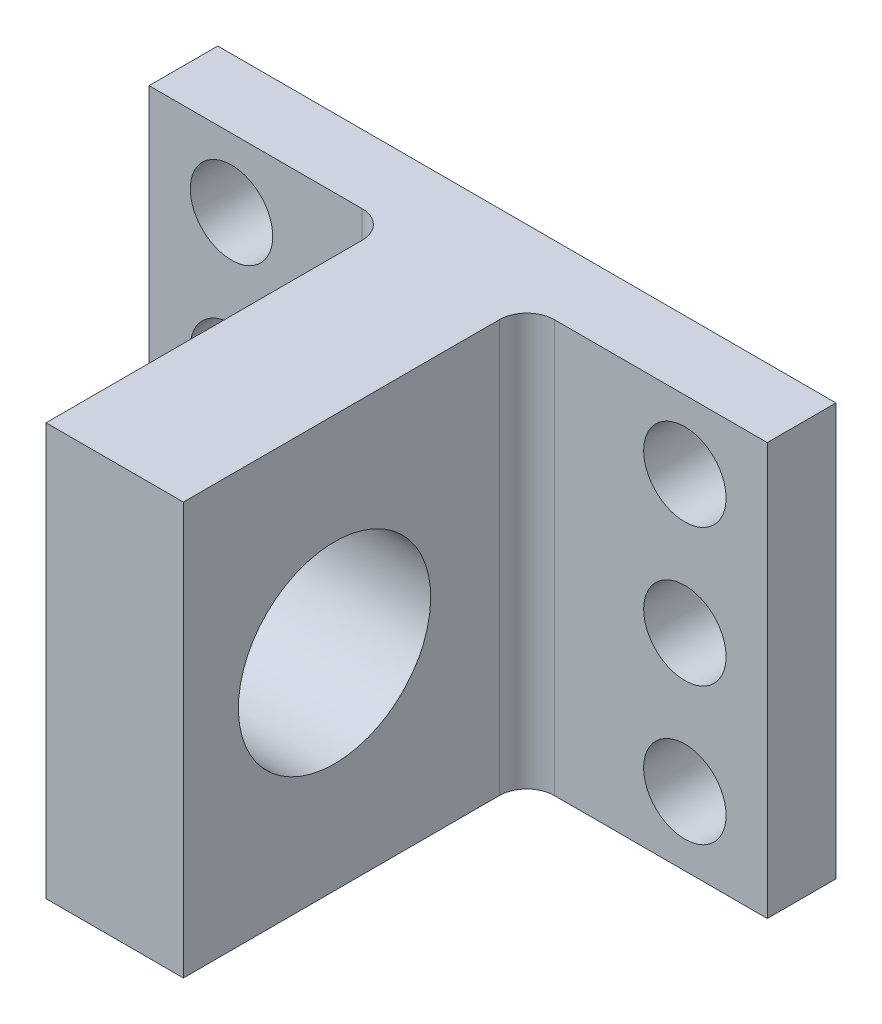
ISO-10303-21;
HEADER;
FILE_DESCRIPTION(('STEP AP214'),'2;1');
FILE_NAME('part.step','',(''),(''),'','','');
FILE_SCHEMA(('AUTOMOTIVE_DESIGN { 1 0 10303 214 1 1 1 1 }'));
ENDSEC;
DATA;
#1=APPLICATION_CONTEXT('core data for automotive mechanical design processes');
#2=APPLICATION_PROTOCOL_DEFINITION('international standard','automotive_design',2000,#1);
#3=PRODUCT_CONTEXT('',#1,'mechanical');
#4=PRODUCT('Part','Part','',(#3));
#5=PRODUCT_RELATED_PRODUCT_CATEGORY('part','',(#4));
#6=PRODUCT_DEFINITION_FORMATION('','',#4);
#7=PRODUCT_DEFINITION_CONTEXT('part definition',#1,'design');
#8=PRODUCT_DEFINITION('design','',#6,#7);
#9=PRODUCT_DEFINITION_SHAPE('','',#8);
#10=(LENGTH_UNIT() NAMED_UNIT(*) SI_UNIT(.MILLI.,.METRE.));
#11=(NAMED_UNIT(*) PLANE_ANGLE_UNIT() SI_UNIT($,.RADIAN.));
#12=(NAMED_UNIT(*) SI_UNIT($,.STERADIAN.) SOLID_ANGLE_UNIT());
#13=UNCERTAINTY_MEASURE_WITH_UNIT(LENGTH_MEASURE(1.E-05),#10,'distance_accuracy_value','');
#14=(GEOMETRIC_REPRESENTATION_CONTEXT(3) GLOBAL_UNCERTAINTY_ASSIGNED_CONTEXT((#13)) GLOBAL_UNIT_ASSIGNED_CONTEXT((#10,
#11,#12)) REPRESENTATION_CONTEXT('',''));
#15=CARTESIAN_POINT('',(0.,0.,0.));
#16=DIRECTION('',(0.,0.,1.));
#17=DIRECTION('',(1.,0.,0.));
#18=AXIS2_PLACEMENT_3D('',#15,#16,#17);
#19=CARTESIAN_POINT('',(7.,0.,7.));
#20=DIRECTION('',(0.,-1.,0.));
#21=DIRECTION('',(1.,0.,0.));
#22=AXIS2_PLACEMENT_3D('',#19,#20,#21);
#23=CYLINDRICAL_SURFACE('',#22,2.);
#24=DIRECTION('',(0.,-1.,0.));
#25=VECTOR('',#24,1.);
#26=CARTESIAN_POINT('',(7.,0.,5.));
#27=LINE('',#26,#25);
#28=CARTESIAN_POINT('',(6.99999999999999,15.,5.));
#29=VERTEX_POINT('',#28);
#30=CARTESIAN_POINT('',(6.99999999999999,-15.,5.));
#31=VERTEX_POINT('',#30);
#32=EDGE_CURVE('E177',#29,#31,#27,.T.);
#33=ORIENTED_EDGE('',*,*,#32,.F.);
#34=CARTESIAN_POINT('',(7.,15.,7.));
#35=DIRECTION('',(0.,-1.,0.));
#36=DIRECTION('',(0.,0.,-1.));
#37=AXIS2_PLACEMENT_3D('',#34,#35,#36);
#38=CIRCLE('',#37,2.);
#39=CARTESIAN_POINT('',(5.,15.,7.));
#40=VERTEX_POINT('',#39);
#41=EDGE_CURVE('E40',#29,#40,#38,.F.);
#42=ORIENTED_EDGE('',*,*,#41,.T.);
#43=DIRECTION('',(0.,-1.,0.));
#44=VECTOR('',#43,1.);
#45=CARTESIAN_POINT('',(5.,15.,7.));
#46=LINE('',#45,#44);
#47=CARTESIAN_POINT('',(5.,-15.,7.));
#48=VERTEX_POINT('',#47);
#49=EDGE_CURVE('E180',#48,#40,#46,.F.);
#50=ORIENTED_EDGE('',*,*,#49,.F.);
#51=CARTESIAN_POINT('',(7.,-15.,7.));
#52=DIRECTION('',(0.,1.,0.));
#53=DIRECTION('',(0.,0.,1.));
#54=AXIS2_PLACEMENT_3D('',#51,#52,#53);
#55=CIRCLE('',#54,2.);
#56=EDGE_CURVE('E11',#48,#31,#55,.F.);
#57=ORIENTED_EDGE('',*,*,#56,.T.);
#58=EDGE_LOOP('',(#33,#42,#50,#57));
#59=FACE_BOUND('',#58,.T.);
#60=ADVANCED_FACE('F33',(#59),#23,.F.);
#61=CARTESIAN_POINT('',(-7.,15.,7.));
#62=DIRECTION('',(0.,-1.,0.));
#63=DIRECTION('',(1.,0.,0.));
#64=AXIS2_PLACEMENT_3D('',#61,#62,#63);
#65=CYLINDRICAL_SURFACE('',#64,2.);
#66=DIRECTION('',(0.,-1.,0.));
#67=VECTOR('',#66,1.);
#68=CARTESIAN_POINT('',(-5.,15.,7.));
#69=LINE('',#68,#67);
#70=CARTESIAN_POINT('',(-5.,15.,7.));
#71=VERTEX_POINT('',#70);
#72=CARTESIAN_POINT('',(-5.,-15.,7.));
#73=VERTEX_POINT('',#72);
#74=EDGE_CURVE('E129',#71,#73,#69,.T.);
#75=ORIENTED_EDGE('',*,*,#74,.F.);
#76=CARTESIAN_POINT('',(-7.,15.,7.));
#77=DIRECTION('',(0.,-1.,0.));
#78=DIRECTION('',(0.,0.,-1.));
#79=AXIS2_PLACEMENT_3D('',#76,#77,#78);
#80=CIRCLE('',#79,2.);
#81=CARTESIAN_POINT('',(-7.00000000000001,15.,5.));
#82=VERTEX_POINT('',#81);
#83=EDGE_CURVE('E173',#71,#82,#80,.F.);
#84=ORIENTED_EDGE('',*,*,#83,.T.);
#85=DIRECTION('',(0.,-1.,0.));
#86=VECTOR('',#85,1.);
#87=CARTESIAN_POINT('',(-7.,0.,5.));
#88=LINE('',#87,#86);
#89=CARTESIAN_POINT('',(-7.,-15.,5.));
#90=VERTEX_POINT('',#89);
#91=EDGE_CURVE('E170',#90,#82,#88,.F.);
#92=ORIENTED_EDGE('',*,*,#91,.F.);
#93=CARTESIAN_POINT('',(-7.,-15.,7.));
#94=DIRECTION('',(0.,1.,0.));
#95=DIRECTION('',(0.,0.,1.));
#96=AXIS2_PLACEMENT_3D('',#93,#94,#95);
#97=CIRCLE('',#96,2.);
#98=EDGE_CURVE('E175',#90,#73,#97,.F.);
#99=ORIENTED_EDGE('',*,*,#98,.T.);
#100=EDGE_LOOP('',(#75,#84,#92,#99));
#101=FACE_BOUND('',#100,.T.);
#102=ADVANCED_FACE('F268',(#101),#65,.F.);
#103=CARTESIAN_POINT('',(0.,0.,5.));
#104=DIRECTION('',(0.,0.,1.));
#105=DIRECTION('',(1.,0.,0.));
#106=AXIS2_PLACEMENT_3D('',#103,#104,#105);
#107=PLANE('',#106);
#108=CARTESIAN_POINT('',(-16.5,0.,5.));
#109=DIRECTION('',(0.,0.,1.));
#110=DIRECTION('',(1.,0.,0.));
#111=AXIS2_PLACEMENT_3D('',#108,#109,#110);
#112=CIRCLE('',#111,3.);
#113=CARTESIAN_POINT('',(-13.5,0.,5.));
#114=VERTEX_POINT('',#113);
#115=EDGE_CURVE('E224',#114,#114,#112,.T.);
#116=ORIENTED_EDGE('',*,*,#115,.F.);
#117=EDGE_LOOP('',(#116));
#118=FACE_BOUND('',#117,.T.);
#119=CARTESIAN_POINT('',(-16.5,10.,5.));
#120=DIRECTION('',(0.,0.,1.));
#121=DIRECTION('',(1.,0.,0.));
#122=AXIS2_PLACEMENT_3D('',#119,#120,#121);
#123=CIRCLE('',#122,3.);
#124=CARTESIAN_POINT('',(-13.5,10.,5.));
#125=VERTEX_POINT('',#124);
#126=EDGE_CURVE('E218',#125,#125,#123,.T.);
#127=ORIENTED_EDGE('',*,*,#126,.F.);
#128=EDGE_LOOP('',(#127));
#129=FACE_BOUND('',#128,.T.);
#130=CARTESIAN_POINT('',(-16.5,-9.99999999999999,5.));
#131=DIRECTION('',(0.,0.,1.));
#132=DIRECTION('',(-1.,0.,0.));
#133=AXIS2_PLACEMENT_3D('',#130,#131,#132);
#134=CIRCLE('',#133,3.);
#135=CARTESIAN_POINT('',(-19.5,-9.99999999999999,5.));
#136=VERTEX_POINT('',#135);
#137=EDGE_CURVE('E199',#136,#136,#134,.T.);
#138=ORIENTED_EDGE('',*,*,#137,.F.);
#139=EDGE_LOOP('',(#138));
#140=FACE_BOUND('',#139,.T.);
#141=DIRECTION('',(1.,0.,0.));
#142=VECTOR('',#141,1.);
#143=CARTESIAN_POINT('',(-22.5,-15.,5.));
#144=LINE('',#143,#142);
#145=CARTESIAN_POINT('',(-22.5,-15.,5.));
#146=VERTEX_POINT('',#145);
#147=EDGE_CURVE('E144',#146,#90,#144,.T.);
#148=ORIENTED_EDGE('',*,*,#147,.T.);
#149=ORIENTED_EDGE('',*,*,#91,.T.);
#150=DIRECTION('',(-1.,0.,0.));
#151=VECTOR('',#150,1.);
#152=CARTESIAN_POINT('',(-22.5,15.,5.));
#153=LINE('',#152,#151);
#154=CARTESIAN_POINT('',(-22.5,15.,5.));
#155=VERTEX_POINT('',#154);
#156=EDGE_CURVE('E149',#82,#155,#153,.T.);
#157=ORIENTED_EDGE('',*,*,#156,.T.);
#158=DIRECTION('',(0.,-1.,0.));
#159=VECTOR('',#158,1.);
#160=CARTESIAN_POINT('',(-22.5,15.,5.));
#161=LINE('',#160,#159);
#162=EDGE_CURVE('E139',#155,#146,#161,.T.);
#163=ORIENTED_EDGE('',*,*,#162,.T.);
#164=EDGE_LOOP('',(#148,#149,#157,#163));
#165=FACE_BOUND('',#164,.T.);
#166=ADVANCED_FACE('F251',(#118,#129,#140,#165),#107,.T.);
#167=CARTESIAN_POINT('',(-22.5,15.,5.));
#168=DIRECTION('',(1.,0.,0.));
#169=DIRECTION('',(0.,1.,0.));
#170=AXIS2_PLACEMENT_3D('',#167,#168,#169);
#171=PLANE('',#170);
#172=DIRECTION('',(0.,-1.,0.));
#173=VECTOR('',#172,1.);
#174=CARTESIAN_POINT('',(-22.5,15.,0.));
#175=LINE('',#174,#173);
#176=CARTESIAN_POINT('',(-22.5,15.,0.));
#177=VERTEX_POINT('',#176);
#178=CARTESIAN_POINT('',(-22.5,-15.,0.));
#179=VERTEX_POINT('',#178);
#180=EDGE_CURVE('E130',#177,#179,#175,.T.);
#181=ORIENTED_EDGE('',*,*,#180,.T.);
#182=DIRECTION('',(0.,0.,-1.));
#183=VECTOR('',#182,1.);
#184=CARTESIAN_POINT('',(-22.5,-15.,5.));
#185=LINE('',#184,#183);
#186=EDGE_CURVE('E166',#146,#179,#185,.T.);
#187=ORIENTED_EDGE('',*,*,#186,.F.);
#188=ORIENTED_EDGE('',*,*,#162,.F.);
#189=DIRECTION('',(0.,0.,-1.));
#190=VECTOR('',#189,1.);
#191=CARTESIAN_POINT('',(-22.5,15.,5.));
#192=LINE('',#191,#190);
#193=EDGE_CURVE('E152',#155,#177,#192,.T.);
#194=ORIENTED_EDGE('',*,*,#193,.T.);
#195=EDGE_LOOP('',(#181,#187,#188,#194));
#196=FACE_BOUND('',#195,.T.);
#197=ADVANCED_FACE('F262',(#196),#171,.F.);
#198=CARTESIAN_POINT('',(-22.5,-15.,5.));
#199=DIRECTION('',(0.,1.,0.));
#200=DIRECTION('',(0.,0.,1.));
#201=AXIS2_PLACEMENT_3D('',#198,#199,#200);
#202=PLANE('',#201);
#203=DIRECTION('',(1.,0.,0.));
#204=VECTOR('',#203,1.);
#205=CARTESIAN_POINT('',(-22.5,-15.,0.));
#206=LINE('',#205,#204);
#207=CARTESIAN_POINT('',(22.5,-15.,0.));
#208=VERTEX_POINT('',#207);
#209=EDGE_CURVE('E133',#179,#208,#206,.T.);
#210=ORIENTED_EDGE('',*,*,#209,.T.);
#211=DIRECTION('',(0.,0.,-1.));
#212=VECTOR('',#211,1.);
#213=CARTESIAN_POINT('',(22.5,-15.,5.));
#214=LINE('',#213,#212);
#215=CARTESIAN_POINT('',(22.5,-15.,5.));
#216=VERTEX_POINT('',#215);
#217=EDGE_CURVE('E163',#216,#208,#214,.T.);
#218=ORIENTED_EDGE('',*,*,#217,.F.);
#219=EDGE_CURVE('E142',#31,#216,#144,.T.);
#220=ORIENTED_EDGE('',*,*,#219,.F.);
#221=ORIENTED_EDGE('',*,*,#56,.F.);
#222=DIRECTION('',(0.,0.,-1.));
#223=VECTOR('',#222,1.);
#224=CARTESIAN_POINT('',(5.,-15.,30.));
#225=LINE('',#224,#223);
#226=CARTESIAN_POINT('',(5.,-15.,30.));
#227=VERTEX_POINT('',#226);
#228=EDGE_CURVE('E111',#227,#48,#225,.T.);
#229=ORIENTED_EDGE('',*,*,#228,.F.);
#230=DIRECTION('',(1.,0.,0.));
#231=VECTOR('',#230,1.);
#232=CARTESIAN_POINT('',(-5.,-15.,30.));
#233=LINE('',#232,#231);
#234=CARTESIAN_POINT('',(-5.,-15.,30.));
#235=VERTEX_POINT('',#234);
#236=EDGE_CURVE('E105',#235,#227,#233,.T.);
#237=ORIENTED_EDGE('',*,*,#236,.F.);
#238=DIRECTION('',(0.,0.,-1.));
#239=VECTOR('',#238,1.);
#240=CARTESIAN_POINT('',(-5.,-15.,30.));
#241=LINE('',#240,#239);
#242=EDGE_CURVE('E109',#235,#73,#241,.T.);
#243=ORIENTED_EDGE('',*,*,#242,.T.);
#244=ORIENTED_EDGE('',*,*,#98,.F.);
#245=ORIENTED_EDGE('',*,*,#147,.F.);
#246=ORIENTED_EDGE('',*,*,#186,.T.);
#247=EDGE_LOOP('',(#210,#218,#220,#221,#229,#237,#243,#244,#245,#246));
#248=FACE_BOUND('',#247,.T.);
#249=ADVANCED_FACE('F107',(#248),#202,.F.);
#250=CARTESIAN_POINT('',(22.5,15.,5.));
#251=DIRECTION('',(-1.,0.,0.));
#252=DIRECTION('',(0.,-1.,0.));
#253=AXIS2_PLACEMENT_3D('',#250,#251,#252);
#254=PLANE('',#253);
#255=DIRECTION('',(0.,1.,0.));
#256=VECTOR('',#255,1.);
#257=CARTESIAN_POINT('',(22.5,15.,0.));
#258=LINE('',#257,#256);
#259=CARTESIAN_POINT('',(22.5,15.,0.));
#260=VERTEX_POINT('',#259);
#261=EDGE_CURVE('E155',#208,#260,#258,.T.);
#262=ORIENTED_EDGE('',*,*,#261,.T.);
#263=DIRECTION('',(0.,0.,-1.));
#264=VECTOR('',#263,1.);
#265=CARTESIAN_POINT('',(22.5,15.,5.));
#266=LINE('',#265,#264);
#267=CARTESIAN_POINT('',(22.5,15.,5.));
#268=VERTEX_POINT('',#267);
#269=EDGE_CURVE('E160',#268,#260,#266,.T.);
#270=ORIENTED_EDGE('',*,*,#269,.F.);
#271=DIRECTION('',(0.,1.,0.));
#272=VECTOR('',#271,1.);
#273=CARTESIAN_POINT('',(22.5,15.,5.));
#274=LINE('',#273,#272);
#275=EDGE_CURVE('E147',#216,#268,#274,.T.);
#276=ORIENTED_EDGE('',*,*,#275,.F.);
#277=ORIENTED_EDGE('',*,*,#217,.T.);
#278=EDGE_LOOP('',(#262,#270,#276,#277));
#279=FACE_BOUND('',#278,.T.);
#280=ADVANCED_FACE('F270',(#279),#254,.F.);
#281=CARTESIAN_POINT('',(-22.5,15.,5.));
#282=DIRECTION('',(0.,-1.,0.));
#283=DIRECTION('',(0.,0.,-1.));
#284=AXIS2_PLACEMENT_3D('',#281,#282,#283);
#285=PLANE('',#284);
#286=DIRECTION('',(-1.,0.,0.));
#287=VECTOR('',#286,1.);
#288=CARTESIAN_POINT('',(-22.5,15.,0.));
#289=LINE('',#288,#287);
#290=EDGE_CURVE('E143',#260,#177,#289,.T.);
#291=ORIENTED_EDGE('',*,*,#290,.T.);
#292=ORIENTED_EDGE('',*,*,#193,.F.);
#293=ORIENTED_EDGE('',*,*,#156,.F.);
#294=ORIENTED_EDGE('',*,*,#83,.F.);
#295=DIRECTION('',(0.,0.,-1.));
#296=VECTOR('',#295,1.);
#297=CARTESIAN_POINT('',(-5.,15.,30.));
#298=LINE('',#297,#296);
#299=CARTESIAN_POINT('',(-5.,15.,30.));
#300=VERTEX_POINT('',#299);
#301=EDGE_CURVE('E188',#300,#71,#298,.T.);
#302=ORIENTED_EDGE('',*,*,#301,.F.);
#303=DIRECTION('',(-1.,0.,0.));
#304=VECTOR('',#303,1.);
#305=CARTESIAN_POINT('',(-5.,15.,30.));
#306=LINE('',#305,#304);
#307=CARTESIAN_POINT('',(5.,15.,30.));
#308=VERTEX_POINT('',#307);
#309=EDGE_CURVE('E120',#308,#300,#306,.T.);
#310=ORIENTED_EDGE('',*,*,#309,.F.);
#311=DIRECTION('',(0.,0.,-1.));
#312=VECTOR('',#311,1.);
#313=CARTESIAN_POINT('',(5.,15.,30.));
#314=LINE('',#313,#312);
#315=EDGE_CURVE('E135',#308,#40,#314,.T.);
#316=ORIENTED_EDGE('',*,*,#315,.T.);
#317=ORIENTED_EDGE('',*,*,#41,.F.);
#318=EDGE_CURVE('E150',#268,#29,#153,.T.);
#319=ORIENTED_EDGE('',*,*,#318,.F.);
#320=ORIENTED_EDGE('',*,*,#269,.T.);
#321=EDGE_LOOP('',(#291,#292,#293,#294,#302,#310,#316,#317,#319,#320));
#322=FACE_BOUND('',#321,.T.);
#323=ADVANCED_FACE('F186',(#322),#285,.F.);
#324=CARTESIAN_POINT('',(16.5,-9.99999999999999,5.));
#325=DIRECTION('',(0.,0.,1.));
#326=DIRECTION('',(1.,0.,0.));
#327=AXIS2_PLACEMENT_3D('',#324,#325,#326);
#328=CIRCLE('',#327,3.);
#329=CARTESIAN_POINT('',(19.5,-9.99999999999999,5.));
#330=VERTEX_POINT('',#329);
#331=EDGE_CURVE('E212',#330,#330,#328,.T.);
#332=ORIENTED_EDGE('',*,*,#331,.F.);
#333=EDGE_LOOP('',(#332));
#334=FACE_BOUND('',#333,.T.);
#335=CARTESIAN_POINT('',(16.5,0.,5.));
#336=DIRECTION('',(0.,0.,1.));
#337=DIRECTION('',(-1.,0.,0.));
#338=AXIS2_PLACEMENT_3D('',#335,#336,#337);
#339=CIRCLE('',#338,3.);
#340=CARTESIAN_POINT('',(13.5,0.,5.));
#341=VERTEX_POINT('',#340);
#342=EDGE_CURVE('E205',#341,#341,#339,.T.);
#343=ORIENTED_EDGE('',*,*,#342,.F.);
#344=EDGE_LOOP('',(#343));
#345=FACE_BOUND('',#344,.T.);
#346=CARTESIAN_POINT('',(16.5,10.,5.));
#347=DIRECTION('',(0.,0.,1.));
#348=DIRECTION('',(-1.,0.,0.));
#349=AXIS2_PLACEMENT_3D('',#346,#347,#348);
#350=CIRCLE('',#349,3.);
#351=CARTESIAN_POINT('',(13.5,10.,5.));
#352=VERTEX_POINT('',#351);
#353=EDGE_CURVE('E229',#352,#352,#350,.T.);
#354=ORIENTED_EDGE('',*,*,#353,.F.);
#355=EDGE_LOOP('',(#354));
#356=FACE_BOUND('',#355,.T.);
#357=ORIENTED_EDGE('',*,*,#318,.T.);
#358=ORIENTED_EDGE('',*,*,#32,.T.);
#359=ORIENTED_EDGE('',*,*,#219,.T.);
#360=ORIENTED_EDGE('',*,*,#275,.T.);
#361=EDGE_LOOP('',(#357,#358,#359,#360));
#362=FACE_BOUND('',#361,.T.);
#363=ADVANCED_FACE('F246',(#334,#345,#356,#362),#107,.T.);
#364=CARTESIAN_POINT('',(0.,0.,0.));
#365=DIRECTION('',(0.,0.,1.));
#366=DIRECTION('',(1.,0.,0.));
#367=AXIS2_PLACEMENT_3D('',#364,#365,#366);
#368=PLANE('',#367);
#369=CARTESIAN_POINT('',(-16.5,0.,0.));
#370=DIRECTION('',(0.,0.,1.));
#371=DIRECTION('',(1.,0.,0.));
#372=AXIS2_PLACEMENT_3D('',#369,#370,#371);
#373=CIRCLE('',#372,3.);
#374=CARTESIAN_POINT('',(-13.5,0.,0.));
#375=VERTEX_POINT('',#374);
#376=EDGE_CURVE('E202',#375,#375,#373,.T.);
#377=ORIENTED_EDGE('',*,*,#376,.T.);
#378=EDGE_LOOP('',(#377));
#379=FACE_BOUND('',#378,.T.);
#380=CARTESIAN_POINT('',(-16.5,10.,0.));
#381=DIRECTION('',(0.,0.,1.));
#382=DIRECTION('',(1.,0.,0.));
#383=AXIS2_PLACEMENT_3D('',#380,#381,#382);
#384=CIRCLE('',#383,3.);
#385=CARTESIAN_POINT('',(-13.5,10.,0.));
#386=VERTEX_POINT('',#385);
#387=EDGE_CURVE('E221',#386,#386,#384,.T.);
#388=ORIENTED_EDGE('',*,*,#387,.T.);
#389=EDGE_LOOP('',(#388));
#390=FACE_BOUND('',#389,.T.);
#391=CARTESIAN_POINT('',(16.5,-9.99999999999999,0.));
#392=DIRECTION('',(0.,0.,1.));
#393=DIRECTION('',(1.,0.,0.));
#394=AXIS2_PLACEMENT_3D('',#391,#392,#393);
#395=CIRCLE('',#394,3.);
#396=CARTESIAN_POINT('',(19.5,-9.99999999999999,0.));
#397=VERTEX_POINT('',#396);
#398=EDGE_CURVE('E215',#397,#397,#395,.T.);
#399=ORIENTED_EDGE('',*,*,#398,.T.);
#400=EDGE_LOOP('',(#399));
#401=FACE_BOUND('',#400,.T.);
#402=CARTESIAN_POINT('',(16.5,0.,0.));
#403=DIRECTION('',(0.,0.,1.));
#404=DIRECTION('',(-1.,0.,0.));
#405=AXIS2_PLACEMENT_3D('',#402,#403,#404);
#406=CIRCLE('',#405,3.);
#407=CARTESIAN_POINT('',(13.5,0.,0.));
#408=VERTEX_POINT('',#407);
#409=EDGE_CURVE('E208',#408,#408,#406,.T.);
#410=ORIENTED_EDGE('',*,*,#409,.T.);
#411=EDGE_LOOP('',(#410));
#412=FACE_BOUND('',#411,.T.);
#413=CARTESIAN_POINT('',(16.5,10.,0.));
#414=DIRECTION('',(0.,0.,1.));
#415=DIRECTION('',(-1.,0.,0.));
#416=AXIS2_PLACEMENT_3D('',#413,#414,#415);
#417=CIRCLE('',#416,3.);
#418=CARTESIAN_POINT('',(13.5,10.,0.));
#419=VERTEX_POINT('',#418);
#420=EDGE_CURVE('E209',#419,#419,#417,.T.);
#421=ORIENTED_EDGE('',*,*,#420,.T.);
#422=EDGE_LOOP('',(#421));
#423=FACE_BOUND('',#422,.T.);
#424=CARTESIAN_POINT('',(-16.5,-9.99999999999999,0.));
#425=DIRECTION('',(0.,0.,1.));
#426=DIRECTION('',(-1.,0.,0.));
#427=AXIS2_PLACEMENT_3D('',#424,#425,#426);
#428=CIRCLE('',#427,3.);
#429=CARTESIAN_POINT('',(-19.5,-9.99999999999999,0.));
#430=VERTEX_POINT('',#429);
#431=EDGE_CURVE('E196',#430,#430,#428,.T.);
#432=ORIENTED_EDGE('',*,*,#431,.T.);
#433=EDGE_LOOP('',(#432));
#434=FACE_BOUND('',#433,.T.);
#435=ORIENTED_EDGE('',*,*,#180,.F.);
#436=ORIENTED_EDGE('',*,*,#290,.F.);
#437=ORIENTED_EDGE('',*,*,#261,.F.);
#438=ORIENTED_EDGE('',*,*,#209,.F.);
#439=EDGE_LOOP('',(#435,#436,#437,#438));
#440=FACE_BOUND('',#439,.T.);
#441=ADVANCED_FACE('F235',(#379,#390,#401,#412,#423,#434,#440),#368,.F.);
#442=CARTESIAN_POINT('',(-5.,15.,30.));
#443=DIRECTION('',(1.,0.,0.));
#444=DIRECTION('',(0.,1.,0.));
#445=AXIS2_PLACEMENT_3D('',#442,#443,#444);
#446=PLANE('',#445);
#447=CARTESIAN_POINT('',(-5.,0.,19.));
#448=DIRECTION('',(-1.,0.,0.));
#449=DIRECTION('',(0.,-1.,0.));
#450=AXIS2_PLACEMENT_3D('',#447,#448,#449);
#451=CIRCLE('',#450,7.);
#452=CARTESIAN_POINT('',(-5.,-7.,19.));
#453=VERTEX_POINT('',#452);
#454=EDGE_CURVE('E193',#453,#453,#451,.T.);
#455=ORIENTED_EDGE('',*,*,#454,.F.);
#456=EDGE_LOOP('',(#455));
#457=FACE_BOUND('',#456,.T.);
#458=ORIENTED_EDGE('',*,*,#301,.T.);
#459=ORIENTED_EDGE('',*,*,#74,.T.);
#460=ORIENTED_EDGE('',*,*,#242,.F.);
#461=DIRECTION('',(0.,-1.,0.));
#462=VECTOR('',#461,1.);
#463=CARTESIAN_POINT('',(-5.,15.,30.));
#464=LINE('',#463,#462);
#465=EDGE_CURVE('E115',#300,#235,#464,.T.);
#466=ORIENTED_EDGE('',*,*,#465,.F.);
#467=EDGE_LOOP('',(#458,#459,#460,#466));
#468=FACE_BOUND('',#467,.T.);
#469=ADVANCED_FACE('F127',(#457,#468),#446,.F.);
#470=CARTESIAN_POINT('',(5.,15.,30.));
#471=DIRECTION('',(-1.,0.,0.));
#472=DIRECTION('',(0.,-1.,0.));
#473=AXIS2_PLACEMENT_3D('',#470,#471,#472);
#474=PLANE('',#473);
#475=CARTESIAN_POINT('',(5.,0.,19.));
#476=DIRECTION('',(-1.,0.,0.));
#477=DIRECTION('',(0.,-1.,0.));
#478=AXIS2_PLACEMENT_3D('',#475,#476,#477);
#479=CIRCLE('',#478,7.);
#480=CARTESIAN_POINT('',(5.,-7.,19.));
#481=VERTEX_POINT('',#480);
#482=EDGE_CURVE('E124',#481,#481,#479,.T.);
#483=ORIENTED_EDGE('',*,*,#482,.T.);
#484=EDGE_LOOP('',(#483));
#485=FACE_BOUND('',#484,.T.);
#486=ORIENTED_EDGE('',*,*,#228,.T.);
#487=ORIENTED_EDGE('',*,*,#49,.T.);
#488=ORIENTED_EDGE('',*,*,#315,.F.);
#489=DIRECTION('',(0.,1.,0.));
#490=VECTOR('',#489,1.);
#491=CARTESIAN_POINT('',(5.,15.,30.));
#492=LINE('',#491,#490);
#493=EDGE_CURVE('E114',#227,#308,#492,.T.);
#494=ORIENTED_EDGE('',*,*,#493,.F.);
#495=EDGE_LOOP('',(#486,#487,#488,#494));
#496=FACE_BOUND('',#495,.T.);
#497=ADVANCED_FACE('F184',(#485,#496),#474,.F.);
#498=CARTESIAN_POINT('',(0.,0.,30.));
#499=DIRECTION('',(0.,0.,1.));
#500=DIRECTION('',(1.,0.,0.));
#501=AXIS2_PLACEMENT_3D('',#498,#499,#500);
#502=PLANE('',#501);
#503=ORIENTED_EDGE('',*,*,#465,.T.);
#504=ORIENTED_EDGE('',*,*,#236,.T.);
#505=ORIENTED_EDGE('',*,*,#493,.T.);
#506=ORIENTED_EDGE('',*,*,#309,.T.);
#507=EDGE_LOOP('',(#503,#504,#505,#506));
#508=FACE_BOUND('',#507,.T.);
#509=ADVANCED_FACE('F118',(#508),#502,.T.);
#510=CARTESIAN_POINT('',(5.,0.,19.));
#511=DIRECTION('',(-1.,0.,0.));
#512=DIRECTION('',(0.,-1.,0.));
#513=AXIS2_PLACEMENT_3D('',#510,#511,#512);
#514=CYLINDRICAL_SURFACE('',#513,7.);
#515=ORIENTED_EDGE('',*,*,#482,.F.);
#516=EDGE_LOOP('',(#515));
#517=FACE_BOUND('',#516,.T.);
#518=ORIENTED_EDGE('',*,*,#454,.T.);
#519=EDGE_LOOP('',(#518));
#520=FACE_BOUND('',#519,.T.);
#521=ADVANCED_FACE('F338',(#517,#520),#514,.F.);
#522=CARTESIAN_POINT('',(-16.5,-9.99999999999999,0.));
#523=DIRECTION('',(0.,0.,1.));
#524=DIRECTION('',(1.,0.,0.));
#525=AXIS2_PLACEMENT_3D('',#522,#523,#524);
#526=CYLINDRICAL_SURFACE('',#525,3.);
#527=ORIENTED_EDGE('',*,*,#431,.F.);
#528=EDGE_LOOP('',(#527));
#529=FACE_BOUND('',#528,.T.);
#530=ORIENTED_EDGE('',*,*,#137,.T.);
#531=EDGE_LOOP('',(#530));
#532=FACE_BOUND('',#531,.T.);
#533=ADVANCED_FACE('F242',(#529,#532),#526,.F.);
#534=CARTESIAN_POINT('',(16.5,10.,0.));
#535=DIRECTION('',(0.,0.,1.));
#536=DIRECTION('',(1.,0.,0.));
#537=AXIS2_PLACEMENT_3D('',#534,#535,#536);
#538=CYLINDRICAL_SURFACE('',#537,3.);
#539=ORIENTED_EDGE('',*,*,#420,.F.);
#540=EDGE_LOOP('',(#539));
#541=FACE_BOUND('',#540,.T.);
#542=ORIENTED_EDGE('',*,*,#353,.T.);
#543=EDGE_LOOP('',(#542));
#544=FACE_BOUND('',#543,.T.);
#545=ADVANCED_FACE('F238',(#541,#544),#538,.F.);
#546=CARTESIAN_POINT('',(16.5,0.,0.));
#547=DIRECTION('',(0.,0.,1.));
#548=DIRECTION('',(1.,0.,0.));
#549=AXIS2_PLACEMENT_3D('',#546,#547,#548);
#550=CYLINDRICAL_SURFACE('',#549,3.);
#551=ORIENTED_EDGE('',*,*,#409,.F.);
#552=EDGE_LOOP('',(#551));
#553=FACE_BOUND('',#552,.T.);
#554=ORIENTED_EDGE('',*,*,#342,.T.);
#555=EDGE_LOOP('',(#554));
#556=FACE_BOUND('',#555,.T.);
#557=ADVANCED_FACE('F241',(#553,#556),#550,.F.);
#558=CARTESIAN_POINT('',(16.5,-9.99999999999999,0.));
#559=DIRECTION('',(0.,0.,1.));
#560=DIRECTION('',(1.,0.,0.));
#561=AXIS2_PLACEMENT_3D('',#558,#559,#560);
#562=CYLINDRICAL_SURFACE('',#561,3.);
#563=ORIENTED_EDGE('',*,*,#398,.F.);
#564=EDGE_LOOP('',(#563));
#565=FACE_BOUND('',#564,.T.);
#566=ORIENTED_EDGE('',*,*,#331,.T.);
#567=EDGE_LOOP('',(#566));
#568=FACE_BOUND('',#567,.T.);
#569=ADVANCED_FACE('F363',(#565,#568),#562,.F.);
#570=CARTESIAN_POINT('',(-16.5,10.,0.));
#571=DIRECTION('',(0.,0.,1.));
#572=DIRECTION('',(1.,0.,0.));
#573=AXIS2_PLACEMENT_3D('',#570,#571,#572);
#574=CYLINDRICAL_SURFACE('',#573,3.);
#575=ORIENTED_EDGE('',*,*,#387,.F.);
#576=EDGE_LOOP('',(#575));
#577=FACE_BOUND('',#576,.T.);
#578=ORIENTED_EDGE('',*,*,#126,.T.);
#579=EDGE_LOOP('',(#578));
#580=FACE_BOUND('',#579,.T.);
#581=ADVANCED_FACE('F371',(#577,#580),#574,.F.);
#582=CARTESIAN_POINT('',(-16.5,0.,0.));
#583=DIRECTION('',(0.,0.,1.));
#584=DIRECTION('',(1.,0.,0.));
#585=AXIS2_PLACEMENT_3D('',#582,#583,#584);
#586=CYLINDRICAL_SURFACE('',#585,3.);
#587=ORIENTED_EDGE('',*,*,#376,.F.);
#588=EDGE_LOOP('',(#587));
#589=FACE_BOUND('',#588,.T.);
#590=ORIENTED_EDGE('',*,*,#115,.T.);
#591=EDGE_LOOP('',(#590));
#592=FACE_BOUND('',#591,.T.);
#593=ADVANCED_FACE('F379',(#589,#592),#586,.F.);
#594=CLOSED_SHELL('',(#60,#102,#166,#197,#249,#280,#323,#363,#441,#469,#497,#509,#521,#533,#545,
#557,#569,#581,#593));
#595=MANIFOLD_SOLID_BREP('B2',#594);
#596=ADVANCED_BREP_SHAPE_REPRESENTATION('',(#18,#595),#14);
#597=SHAPE_DEFINITION_REPRESENTATION(#9,#596);
ENDSEC;
END-ISO-10303-21;
